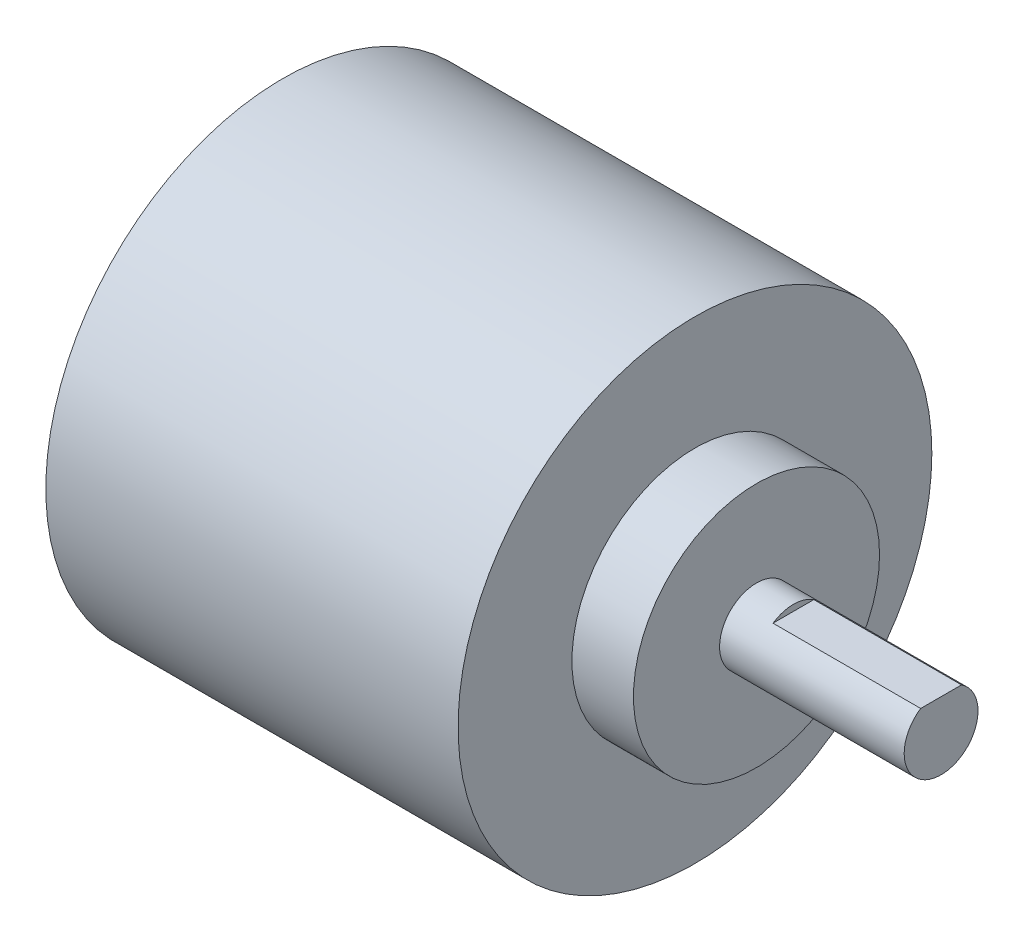
ISO-10303-21;
HEADER;
FILE_DESCRIPTION(('STEP AP214'),'2;1');
FILE_NAME('part.step','',(''),(''),'','','');
FILE_SCHEMA(('AUTOMOTIVE_DESIGN { 1 0 10303 214 1 1 1 1 }'));
ENDSEC;
DATA;
#1=APPLICATION_CONTEXT('core data for automotive mechanical design processes');
#2=APPLICATION_PROTOCOL_DEFINITION('international standard','automotive_design',2000,#1);
#3=PRODUCT_CONTEXT('',#1,'mechanical');
#4=PRODUCT('Part','Part','',(#3));
#5=PRODUCT_RELATED_PRODUCT_CATEGORY('part','',(#4));
#6=PRODUCT_DEFINITION_FORMATION('','',#4);
#7=PRODUCT_DEFINITION_CONTEXT('part definition',#1,'design');
#8=PRODUCT_DEFINITION('design','',#6,#7);
#9=PRODUCT_DEFINITION_SHAPE('','',#8);
#10=(LENGTH_UNIT() NAMED_UNIT(*) SI_UNIT(.MILLI.,.METRE.));
#11=(NAMED_UNIT(*) PLANE_ANGLE_UNIT() SI_UNIT($,.RADIAN.));
#12=(NAMED_UNIT(*) SI_UNIT($,.STERADIAN.) SOLID_ANGLE_UNIT());
#13=UNCERTAINTY_MEASURE_WITH_UNIT(LENGTH_MEASURE(1.E-05),#10,'distance_accuracy_value','');
#14=(GEOMETRIC_REPRESENTATION_CONTEXT(3) GLOBAL_UNCERTAINTY_ASSIGNED_CONTEXT((#13)) GLOBAL_UNIT_ASSIGNED_CONTEXT((#10,
#11,#12)) REPRESENTATION_CONTEXT('',''));
#15=CARTESIAN_POINT('',(0.,0.,0.));
#16=DIRECTION('',(0.,0.,1.));
#17=DIRECTION('',(1.,0.,0.));
#18=AXIS2_PLACEMENT_3D('',#15,#16,#17);
#19=CARTESIAN_POINT('',(33.5,0.,0.));
#20=DIRECTION('',(-1.,0.,0.));
#21=DIRECTION('',(0.,0.,1.));
#22=AXIS2_PLACEMENT_3D('',#19,#20,#21);
#23=CYLINDRICAL_SURFACE('',#22,19.25);
#24=CARTESIAN_POINT('',(33.5,0.,0.));
#25=DIRECTION('',(1.,0.,0.));
#26=DIRECTION('',(0.,0.,-1.));
#27=AXIS2_PLACEMENT_3D('',#24,#25,#26);
#28=CIRCLE('',#27,19.25);
#29=CARTESIAN_POINT('',(33.5,0.,-19.25));
#30=VERTEX_POINT('',#29);
#31=EDGE_CURVE('E95',#30,#30,#28,.T.);
#32=ORIENTED_EDGE('',*,*,#31,.F.);
#33=EDGE_LOOP('',(#32));
#34=FACE_BOUND('',#33,.T.);
#35=CARTESIAN_POINT('',(0.,0.,0.));
#36=DIRECTION('',(1.,0.,0.));
#37=DIRECTION('',(0.,0.,-1.));
#38=AXIS2_PLACEMENT_3D('',#35,#36,#37);
#39=CIRCLE('',#38,19.25);
#40=CARTESIAN_POINT('',(0.,0.,-19.25));
#41=VERTEX_POINT('',#40);
#42=EDGE_CURVE('E50',#41,#41,#39,.T.);
#43=ORIENTED_EDGE('',*,*,#42,.T.);
#44=EDGE_LOOP('',(#43));
#45=FACE_BOUND('',#44,.T.);
#46=ADVANCED_FACE('F47',(#34,#45),#23,.T.);
#47=CARTESIAN_POINT('',(33.5,0.,0.));
#48=DIRECTION('',(1.,0.,0.));
#49=DIRECTION('',(0.,0.,-1.));
#50=AXIS2_PLACEMENT_3D('',#47,#48,#49);
#51=PLANE('',#50);
#52=CARTESIAN_POINT('',(33.5,0.,0.));
#53=DIRECTION('',(1.,0.,0.));
#54=DIRECTION('',(0.,0.,-1.));
#55=AXIS2_PLACEMENT_3D('',#52,#53,#54);
#56=CIRCLE('',#55,10.);
#57=CARTESIAN_POINT('',(33.5,0.,-10.));
#58=VERTEX_POINT('',#57);
#59=EDGE_CURVE('E55',#58,#58,#56,.T.);
#60=ORIENTED_EDGE('',*,*,#59,.F.);
#61=EDGE_LOOP('',(#60));
#62=FACE_BOUND('',#61,.T.);
#63=ORIENTED_EDGE('',*,*,#31,.T.);
#64=EDGE_LOOP('',(#63));
#65=FACE_BOUND('',#64,.T.);
#66=ADVANCED_FACE('F106',(#62,#65),#51,.T.);
#67=CARTESIAN_POINT('',(0.,0.,0.));
#68=DIRECTION('',(1.,0.,0.));
#69=DIRECTION('',(0.,0.,-1.));
#70=AXIS2_PLACEMENT_3D('',#67,#68,#69);
#71=PLANE('',#70);
#72=ORIENTED_EDGE('',*,*,#42,.F.);
#73=EDGE_LOOP('',(#72));
#74=FACE_BOUND('',#73,.T.);
#75=ADVANCED_FACE('F103',(#74),#71,.F.);
#76=CARTESIAN_POINT('',(38.5,0.,0.));
#77=DIRECTION('',(-1.,0.,0.));
#78=DIRECTION('',(0.,0.,1.));
#79=AXIS2_PLACEMENT_3D('',#76,#77,#78);
#80=CYLINDRICAL_SURFACE('',#79,10.);
#81=CARTESIAN_POINT('',(38.5,0.,0.));
#82=DIRECTION('',(1.,0.,0.));
#83=DIRECTION('',(0.,0.,-1.));
#84=AXIS2_PLACEMENT_3D('',#81,#82,#83);
#85=CIRCLE('',#84,10.);
#86=CARTESIAN_POINT('',(38.5,0.,-10.));
#87=VERTEX_POINT('',#86);
#88=EDGE_CURVE('E88',#87,#87,#85,.T.);
#89=ORIENTED_EDGE('',*,*,#88,.F.);
#90=EDGE_LOOP('',(#89));
#91=FACE_BOUND('',#90,.T.);
#92=ORIENTED_EDGE('',*,*,#59,.T.);
#93=EDGE_LOOP('',(#92));
#94=FACE_BOUND('',#93,.T.);
#95=ADVANCED_FACE('F105',(#91,#94),#80,.T.);
#96=CARTESIAN_POINT('',(38.5,0.,0.));
#97=DIRECTION('',(1.,0.,0.));
#98=DIRECTION('',(0.,0.,-1.));
#99=AXIS2_PLACEMENT_3D('',#96,#97,#98);
#100=PLANE('',#99);
#101=CARTESIAN_POINT('',(38.5,0.,0.));
#102=DIRECTION('',(1.,0.,0.));
#103=DIRECTION('',(0.,0.,-1.));
#104=AXIS2_PLACEMENT_3D('',#101,#102,#103);
#105=CIRCLE('',#104,3.);
#106=CARTESIAN_POINT('',(38.5,0.,-3.));
#107=VERTEX_POINT('',#106);
#108=EDGE_CURVE('E11',#107,#107,#105,.T.);
#109=ORIENTED_EDGE('',*,*,#108,.F.);
#110=EDGE_LOOP('',(#109));
#111=FACE_BOUND('',#110,.T.);
#112=ORIENTED_EDGE('',*,*,#88,.T.);
#113=EDGE_LOOP('',(#112));
#114=FACE_BOUND('',#113,.T.);
#115=ADVANCED_FACE('F111',(#111,#114),#100,.T.);
#116=CARTESIAN_POINT('',(53.5,0.,0.));
#117=DIRECTION('',(-1.,0.,0.));
#118=DIRECTION('',(0.,0.,1.));
#119=AXIS2_PLACEMENT_3D('',#116,#117,#118);
#120=CYLINDRICAL_SURFACE('',#119,3.);
#121=CARTESIAN_POINT('',(53.5,0.,0.));
#122=DIRECTION('',(1.,0.,0.));
#123=DIRECTION('',(0.,0.,-1.));
#124=AXIS2_PLACEMENT_3D('',#121,#122,#123);
#125=CIRCLE('',#124,3.);
#126=CARTESIAN_POINT('',(53.5,2.5,1.6583123951777));
#127=VERTEX_POINT('',#126);
#128=CARTESIAN_POINT('',(53.5,2.5,-1.6583123951777));
#129=VERTEX_POINT('',#128);
#130=EDGE_CURVE('E85',#127,#129,#125,.T.);
#131=ORIENTED_EDGE('',*,*,#130,.F.);
#132=DIRECTION('',(1.,0.,0.));
#133=VECTOR('',#132,1.);
#134=CARTESIAN_POINT('',(41.5,2.5,1.6583123951777));
#135=LINE('',#134,#133);
#136=CARTESIAN_POINT('',(41.5,2.5,1.6583123951777));
#137=VERTEX_POINT('',#136);
#138=EDGE_CURVE('E63',#137,#127,#135,.T.);
#139=ORIENTED_EDGE('',*,*,#138,.F.);
#140=CARTESIAN_POINT('',(41.5,0.,0.));
#141=DIRECTION('',(1.,0.,0.));
#142=DIRECTION('',(0.,0.,-1.));
#143=AXIS2_PLACEMENT_3D('',#140,#141,#142);
#144=CIRCLE('',#143,3.);
#145=CARTESIAN_POINT('',(41.5,2.5,-1.6583123951777));
#146=VERTEX_POINT('',#145);
#147=EDGE_CURVE('E79',#146,#137,#144,.T.);
#148=ORIENTED_EDGE('',*,*,#147,.F.);
#149=DIRECTION('',(1.,0.,0.));
#150=VECTOR('',#149,1.);
#151=CARTESIAN_POINT('',(41.5,2.5,-1.6583123951777));
#152=LINE('',#151,#150);
#153=EDGE_CURVE('E69',#146,#129,#152,.T.);
#154=ORIENTED_EDGE('',*,*,#153,.T.);
#155=EDGE_LOOP('',(#131,#139,#148,#154));
#156=FACE_BOUND('',#155,.T.);
#157=ORIENTED_EDGE('',*,*,#108,.T.);
#158=EDGE_LOOP('',(#157));
#159=FACE_BOUND('',#158,.T.);
#160=ADVANCED_FACE('F83',(#156,#159),#120,.T.);
#161=CARTESIAN_POINT('',(53.5,0.,0.));
#162=DIRECTION('',(1.,0.,0.));
#163=DIRECTION('',(0.,0.,-1.));
#164=AXIS2_PLACEMENT_3D('',#161,#162,#163);
#165=PLANE('',#164);
#166=DIRECTION('',(0.,0.,-1.));
#167=VECTOR('',#166,1.);
#168=CARTESIAN_POINT('',(53.5,2.5,1.6583123951777));
#169=LINE('',#168,#167);
#170=EDGE_CURVE('E74',#127,#129,#169,.T.);
#171=ORIENTED_EDGE('',*,*,#170,.F.);
#172=ORIENTED_EDGE('',*,*,#130,.T.);
#173=EDGE_LOOP('',(#171,#172));
#174=FACE_BOUND('',#173,.T.);
#175=ADVANCED_FACE('F87',(#174),#165,.T.);
#176=CARTESIAN_POINT('',(41.5,2.5,1.6583123951777));
#177=DIRECTION('',(0.,-1.,0.));
#178=DIRECTION('',(0.,0.,-1.));
#179=AXIS2_PLACEMENT_3D('',#176,#177,#178);
#180=PLANE('',#179);
#181=ORIENTED_EDGE('',*,*,#170,.T.);
#182=ORIENTED_EDGE('',*,*,#153,.F.);
#183=DIRECTION('',(0.,0.,-1.));
#184=VECTOR('',#183,1.);
#185=CARTESIAN_POINT('',(41.5,2.5,1.6583123951777));
#186=LINE('',#185,#184);
#187=EDGE_CURVE('E220',#137,#146,#186,.T.);
#188=ORIENTED_EDGE('',*,*,#187,.F.);
#189=ORIENTED_EDGE('',*,*,#138,.T.);
#190=EDGE_LOOP('',(#181,#182,#188,#189));
#191=FACE_BOUND('',#190,.T.);
#192=ADVANCED_FACE('F75',(#191),#180,.F.);
#193=CARTESIAN_POINT('',(41.5,0.,0.));
#194=DIRECTION('',(1.,0.,0.));
#195=DIRECTION('',(0.,0.,-1.));
#196=AXIS2_PLACEMENT_3D('',#193,#194,#195);
#197=PLANE('',#196);
#198=ORIENTED_EDGE('',*,*,#147,.T.);
#199=ORIENTED_EDGE('',*,*,#187,.T.);
#200=EDGE_LOOP('',(#198,#199));
#201=FACE_BOUND('',#200,.T.);
#202=ADVANCED_FACE('F175',(#201),#197,.T.);
#203=CLOSED_SHELL('',(#46,#66,#75,#95,#115,#160,#175,#192,#202));
#204=MANIFOLD_SOLID_BREP('B2',#203);
#205=ADVANCED_BREP_SHAPE_REPRESENTATION('',(#18,#204),#14);
#206=SHAPE_DEFINITION_REPRESENTATION(#9,#205);
ENDSEC;
END-ISO-10303-21;
